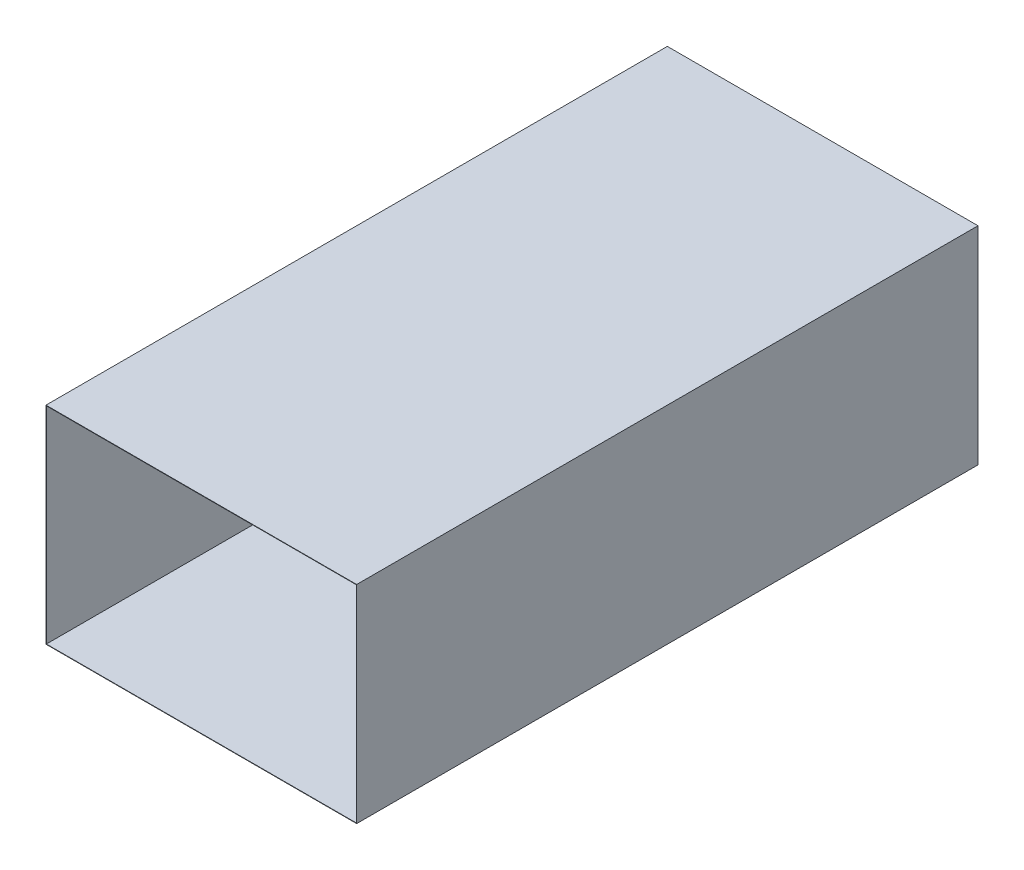
ISO-10303-21;
HEADER;
FILE_DESCRIPTION(('STEP AP214'),'2;1');
FILE_NAME('part.step','',(''),(''),'','','');
FILE_SCHEMA(('AUTOMOTIVE_DESIGN { 1 0 10303 214 1 1 1 1 }'));
ENDSEC;
DATA;
#1=APPLICATION_CONTEXT('core data for automotive mechanical design processes');
#2=APPLICATION_PROTOCOL_DEFINITION('international standard','automotive_design',2000,#1);
#3=PRODUCT_CONTEXT('',#1,'mechanical');
#4=PRODUCT('Part','Part','',(#3));
#5=PRODUCT_RELATED_PRODUCT_CATEGORY('part','',(#4));
#6=PRODUCT_DEFINITION_FORMATION('','',#4);
#7=PRODUCT_DEFINITION_CONTEXT('part definition',#1,'design');
#8=PRODUCT_DEFINITION('design','',#6,#7);
#9=PRODUCT_DEFINITION_SHAPE('','',#8);
#10=(LENGTH_UNIT() NAMED_UNIT(*) SI_UNIT(.MILLI.,.METRE.));
#11=(NAMED_UNIT(*) PLANE_ANGLE_UNIT() SI_UNIT($,.RADIAN.));
#12=(NAMED_UNIT(*) SI_UNIT($,.STERADIAN.) SOLID_ANGLE_UNIT());
#13=UNCERTAINTY_MEASURE_WITH_UNIT(LENGTH_MEASURE(1.E-05),#10,'distance_accuracy_value','');
#14=(GEOMETRIC_REPRESENTATION_CONTEXT(3) GLOBAL_UNCERTAINTY_ASSIGNED_CONTEXT((#13)) GLOBAL_UNIT_ASSIGNED_CONTEXT((#10,
#11,#12)) REPRESENTATION_CONTEXT('',''));
#15=CARTESIAN_POINT('',(0.,0.,0.));
#16=DIRECTION('',(0.,0.,1.));
#17=DIRECTION('',(1.,0.,0.));
#18=AXIS2_PLACEMENT_3D('',#15,#16,#17);
#19=CARTESIAN_POINT('',(0.,0.,3000.));
#20=DIRECTION('',(0.,0.,1.));
#21=DIRECTION('',(1.,0.,0.));
#22=AXIS2_PLACEMENT_3D('',#19,#20,#21);
#23=PLANE('',#22);
#24=DIRECTION('',(0.,1.,0.));
#25=VECTOR('',#24,1.);
#26=CARTESIAN_POINT('',(750.,500.,3000.));
#27=LINE('',#26,#25);
#28=CARTESIAN_POINT('',(750.,-500.,3000.));
#29=VERTEX_POINT('',#28);
#30=CARTESIAN_POINT('',(750.,500.,3000.));
#31=VERTEX_POINT('',#30);
#32=EDGE_CURVE('E158',#29,#31,#27,.T.);
#33=ORIENTED_EDGE('',*,*,#32,.T.);
#34=DIRECTION('',(-1.,0.,0.));
#35=VECTOR('',#34,1.);
#36=CARTESIAN_POINT('',(-750.,500.,3000.));
#37=LINE('',#36,#35);
#38=CARTESIAN_POINT('',(-750.,500.,3000.));
#39=VERTEX_POINT('',#38);
#40=EDGE_CURVE('E161',#31,#39,#37,.T.);
#41=ORIENTED_EDGE('',*,*,#40,.T.);
#42=DIRECTION('',(0.,-1.,0.));
#43=VECTOR('',#42,1.);
#44=CARTESIAN_POINT('',(-750.,500.,3000.));
#45=LINE('',#44,#43);
#46=CARTESIAN_POINT('',(-750.,-500.,3000.));
#47=VERTEX_POINT('',#46);
#48=EDGE_CURVE('E164',#39,#47,#45,.T.);
#49=ORIENTED_EDGE('',*,*,#48,.T.);
#50=DIRECTION('',(1.,0.,0.));
#51=VECTOR('',#50,1.);
#52=CARTESIAN_POINT('',(-750.,-500.,3000.));
#53=LINE('',#52,#51);
#54=EDGE_CURVE('E166',#47,#29,#53,.T.);
#55=ORIENTED_EDGE('',*,*,#54,.T.);
#56=EDGE_LOOP('',(#33,#41,#49,#55));
#57=FACE_BOUND('',#56,.T.);
#58=DIRECTION('',(-1.,0.,0.));
#59=VECTOR('',#58,1.);
#60=CARTESIAN_POINT('',(-750.,498.,3000.));
#61=LINE('',#60,#59);
#62=CARTESIAN_POINT('',(748.,498.,3000.));
#63=VERTEX_POINT('',#62);
#64=CARTESIAN_POINT('',(-748.,498.,3000.));
#65=VERTEX_POINT('',#64);
#66=EDGE_CURVE('E130',#63,#65,#61,.T.);
#67=ORIENTED_EDGE('',*,*,#66,.F.);
#68=DIRECTION('',(0.,1.,0.));
#69=VECTOR('',#68,1.);
#70=CARTESIAN_POINT('',(748.,500.,3000.));
#71=LINE('',#70,#69);
#72=CARTESIAN_POINT('',(748.,-498.,3000.));
#73=VERTEX_POINT('',#72);
#74=EDGE_CURVE('E122',#73,#63,#71,.T.);
#75=ORIENTED_EDGE('',*,*,#74,.F.);
#76=DIRECTION('',(1.,0.,0.));
#77=VECTOR('',#76,1.);
#78=CARTESIAN_POINT('',(-750.,-498.,3000.));
#79=LINE('',#78,#77);
#80=CARTESIAN_POINT('',(-748.,-498.,3000.));
#81=VERTEX_POINT('',#80);
#82=EDGE_CURVE('E144',#81,#73,#79,.T.);
#83=ORIENTED_EDGE('',*,*,#82,.F.);
#84=DIRECTION('',(0.,-1.,0.));
#85=VECTOR('',#84,1.);
#86=CARTESIAN_POINT('',(-748.,500.,3000.));
#87=LINE('',#86,#85);
#88=EDGE_CURVE('E142',#65,#81,#87,.T.);
#89=ORIENTED_EDGE('',*,*,#88,.F.);
#90=EDGE_LOOP('',(#67,#75,#83,#89));
#91=FACE_BOUND('',#90,.T.);
#92=ADVANCED_FACE('F57',(#57,#91),#23,.T.);
#93=CARTESIAN_POINT('',(0.,0.,0.));
#94=DIRECTION('',(0.,0.,1.));
#95=DIRECTION('',(1.,0.,0.));
#96=AXIS2_PLACEMENT_3D('',#93,#94,#95);
#97=PLANE('',#96);
#98=DIRECTION('',(0.,1.,0.));
#99=VECTOR('',#98,1.);
#100=CARTESIAN_POINT('',(750.,500.,0.));
#101=LINE('',#100,#99);
#102=CARTESIAN_POINT('',(750.,-500.,0.));
#103=VERTEX_POINT('',#102);
#104=CARTESIAN_POINT('',(750.,500.,0.));
#105=VERTEX_POINT('',#104);
#106=EDGE_CURVE('E138',#103,#105,#101,.T.);
#107=ORIENTED_EDGE('',*,*,#106,.F.);
#108=DIRECTION('',(1.,0.,0.));
#109=VECTOR('',#108,1.);
#110=CARTESIAN_POINT('',(-750.,-500.,0.));
#111=LINE('',#110,#109);
#112=CARTESIAN_POINT('',(-750.,-500.,0.));
#113=VERTEX_POINT('',#112);
#114=EDGE_CURVE('E162',#113,#103,#111,.T.);
#115=ORIENTED_EDGE('',*,*,#114,.F.);
#116=DIRECTION('',(0.,-1.,0.));
#117=VECTOR('',#116,1.);
#118=CARTESIAN_POINT('',(-750.,500.,0.));
#119=LINE('',#118,#117);
#120=CARTESIAN_POINT('',(-750.,500.,0.));
#121=VERTEX_POINT('',#120);
#122=EDGE_CURVE('E173',#121,#113,#119,.T.);
#123=ORIENTED_EDGE('',*,*,#122,.F.);
#124=DIRECTION('',(-1.,0.,0.));
#125=VECTOR('',#124,1.);
#126=CARTESIAN_POINT('',(-750.,500.,0.));
#127=LINE('',#126,#125);
#128=EDGE_CURVE('E171',#105,#121,#127,.T.);
#129=ORIENTED_EDGE('',*,*,#128,.F.);
#130=EDGE_LOOP('',(#107,#115,#123,#129));
#131=FACE_BOUND('',#130,.T.);
#132=DIRECTION('',(0.,1.,0.));
#133=VECTOR('',#132,1.);
#134=CARTESIAN_POINT('',(748.,500.,0.));
#135=LINE('',#134,#133);
#136=CARTESIAN_POINT('',(748.,-498.,0.));
#137=VERTEX_POINT('',#136);
#138=CARTESIAN_POINT('',(748.,498.,0.));
#139=VERTEX_POINT('',#138);
#140=EDGE_CURVE('E80',#137,#139,#135,.T.);
#141=ORIENTED_EDGE('',*,*,#140,.T.);
#142=DIRECTION('',(-1.,0.,0.));
#143=VECTOR('',#142,1.);
#144=CARTESIAN_POINT('',(-750.,498.,0.));
#145=LINE('',#144,#143);
#146=CARTESIAN_POINT('',(-748.,498.,0.));
#147=VERTEX_POINT('',#146);
#148=EDGE_CURVE('E137',#139,#147,#145,.T.);
#149=ORIENTED_EDGE('',*,*,#148,.T.);
#150=DIRECTION('',(0.,-1.,0.));
#151=VECTOR('',#150,1.);
#152=CARTESIAN_POINT('',(-748.,500.,0.));
#153=LINE('',#152,#151);
#154=CARTESIAN_POINT('',(-748.,-498.,0.));
#155=VERTEX_POINT('',#154);
#156=EDGE_CURVE('E150',#147,#155,#153,.T.);
#157=ORIENTED_EDGE('',*,*,#156,.T.);
#158=DIRECTION('',(1.,0.,0.));
#159=VECTOR('',#158,1.);
#160=CARTESIAN_POINT('',(-750.,-498.,0.));
#161=LINE('',#160,#159);
#162=EDGE_CURVE('E131',#155,#137,#161,.T.);
#163=ORIENTED_EDGE('',*,*,#162,.T.);
#164=EDGE_LOOP('',(#141,#149,#157,#163));
#165=FACE_BOUND('',#164,.T.);
#166=ADVANCED_FACE('F191',(#131,#165),#97,.F.);
#167=CARTESIAN_POINT('',(750.,500.,3000.));
#168=DIRECTION('',(-1.,0.,0.));
#169=DIRECTION('',(0.,-1.,0.));
#170=AXIS2_PLACEMENT_3D('',#167,#168,#169);
#171=PLANE('',#170);
#172=ORIENTED_EDGE('',*,*,#106,.T.);
#173=DIRECTION('',(0.,0.,-1.));
#174=VECTOR('',#173,1.);
#175=CARTESIAN_POINT('',(750.,500.,3000.));
#176=LINE('',#175,#174);
#177=EDGE_CURVE('E12',#31,#105,#176,.T.);
#178=ORIENTED_EDGE('',*,*,#177,.F.);
#179=ORIENTED_EDGE('',*,*,#32,.F.);
#180=DIRECTION('',(0.,0.,-1.));
#181=VECTOR('',#180,1.);
#182=CARTESIAN_POINT('',(750.,-500.,3000.));
#183=LINE('',#182,#181);
#184=EDGE_CURVE('E168',#29,#103,#183,.T.);
#185=ORIENTED_EDGE('',*,*,#184,.T.);
#186=EDGE_LOOP('',(#172,#178,#179,#185));
#187=FACE_BOUND('',#186,.T.);
#188=ADVANCED_FACE('F59',(#187),#171,.F.);
#189=CARTESIAN_POINT('',(-750.,500.,3000.));
#190=DIRECTION('',(0.,-1.,0.));
#191=DIRECTION('',(0.,0.,-1.));
#192=AXIS2_PLACEMENT_3D('',#189,#190,#191);
#193=PLANE('',#192);
#194=ORIENTED_EDGE('',*,*,#128,.T.);
#195=DIRECTION('',(0.,0.,-1.));
#196=VECTOR('',#195,1.);
#197=CARTESIAN_POINT('',(-750.,500.,3000.));
#198=LINE('',#197,#196);
#199=EDGE_CURVE('E65',#39,#121,#198,.T.);
#200=ORIENTED_EDGE('',*,*,#199,.F.);
#201=ORIENTED_EDGE('',*,*,#40,.F.);
#202=ORIENTED_EDGE('',*,*,#177,.T.);
#203=EDGE_LOOP('',(#194,#200,#201,#202));
#204=FACE_BOUND('',#203,.T.);
#205=ADVANCED_FACE('F201',(#204),#193,.F.);
#206=CARTESIAN_POINT('',(-750.,500.,3000.));
#207=DIRECTION('',(1.,0.,0.));
#208=DIRECTION('',(0.,1.,0.));
#209=AXIS2_PLACEMENT_3D('',#206,#207,#208);
#210=PLANE('',#209);
#211=ORIENTED_EDGE('',*,*,#122,.T.);
#212=DIRECTION('',(0.,0.,-1.));
#213=VECTOR('',#212,1.);
#214=CARTESIAN_POINT('',(-750.,-500.,3000.));
#215=LINE('',#214,#213);
#216=EDGE_CURVE('E178',#47,#113,#215,.T.);
#217=ORIENTED_EDGE('',*,*,#216,.F.);
#218=ORIENTED_EDGE('',*,*,#48,.F.);
#219=ORIENTED_EDGE('',*,*,#199,.T.);
#220=EDGE_LOOP('',(#211,#217,#218,#219));
#221=FACE_BOUND('',#220,.T.);
#222=ADVANCED_FACE('F185',(#221),#210,.F.);
#223=CARTESIAN_POINT('',(-750.,-500.,3000.));
#224=DIRECTION('',(0.,1.,0.));
#225=DIRECTION('',(0.,0.,1.));
#226=AXIS2_PLACEMENT_3D('',#223,#224,#225);
#227=PLANE('',#226);
#228=ORIENTED_EDGE('',*,*,#114,.T.);
#229=ORIENTED_EDGE('',*,*,#184,.F.);
#230=ORIENTED_EDGE('',*,*,#54,.F.);
#231=ORIENTED_EDGE('',*,*,#216,.T.);
#232=EDGE_LOOP('',(#228,#229,#230,#231));
#233=FACE_BOUND('',#232,.T.);
#234=ADVANCED_FACE('F195',(#233),#227,.F.);
#235=CARTESIAN_POINT('',(748.,500.,3000.));
#236=DIRECTION('',(-1.,0.,0.));
#237=DIRECTION('',(0.,-1.,0.));
#238=AXIS2_PLACEMENT_3D('',#235,#236,#237);
#239=PLANE('',#238);
#240=ORIENTED_EDGE('',*,*,#140,.F.);
#241=DIRECTION('',(0.,0.,-1.));
#242=VECTOR('',#241,1.);
#243=CARTESIAN_POINT('',(748.,-498.,3000.));
#244=LINE('',#243,#242);
#245=EDGE_CURVE('E126',#73,#137,#244,.T.);
#246=ORIENTED_EDGE('',*,*,#245,.F.);
#247=ORIENTED_EDGE('',*,*,#74,.T.);
#248=DIRECTION('',(0.,0.,-1.));
#249=VECTOR('',#248,1.);
#250=CARTESIAN_POINT('',(748.,498.,3000.));
#251=LINE('',#250,#249);
#252=EDGE_CURVE('E125',#63,#139,#251,.T.);
#253=ORIENTED_EDGE('',*,*,#252,.T.);
#254=EDGE_LOOP('',(#240,#246,#247,#253));
#255=FACE_BOUND('',#254,.T.);
#256=ADVANCED_FACE('F124',(#255),#239,.T.);
#257=CARTESIAN_POINT('',(-750.,498.,3000.));
#258=DIRECTION('',(0.,-1.,0.));
#259=DIRECTION('',(0.,0.,-1.));
#260=AXIS2_PLACEMENT_3D('',#257,#258,#259);
#261=PLANE('',#260);
#262=ORIENTED_EDGE('',*,*,#148,.F.);
#263=ORIENTED_EDGE('',*,*,#252,.F.);
#264=ORIENTED_EDGE('',*,*,#66,.T.);
#265=DIRECTION('',(0.,0.,-1.));
#266=VECTOR('',#265,1.);
#267=CARTESIAN_POINT('',(-748.,498.,3000.));
#268=LINE('',#267,#266);
#269=EDGE_CURVE('E139',#65,#147,#268,.T.);
#270=ORIENTED_EDGE('',*,*,#269,.T.);
#271=EDGE_LOOP('',(#262,#263,#264,#270));
#272=FACE_BOUND('',#271,.T.);
#273=ADVANCED_FACE('F134',(#272),#261,.T.);
#274=CARTESIAN_POINT('',(-748.,500.,3000.));
#275=DIRECTION('',(1.,0.,0.));
#276=DIRECTION('',(0.,1.,0.));
#277=AXIS2_PLACEMENT_3D('',#274,#275,#276);
#278=PLANE('',#277);
#279=ORIENTED_EDGE('',*,*,#156,.F.);
#280=ORIENTED_EDGE('',*,*,#269,.F.);
#281=ORIENTED_EDGE('',*,*,#88,.T.);
#282=DIRECTION('',(0.,0.,-1.));
#283=VECTOR('',#282,1.);
#284=CARTESIAN_POINT('',(-748.,-498.,3000.));
#285=LINE('',#284,#283);
#286=EDGE_CURVE('E72',#81,#155,#285,.T.);
#287=ORIENTED_EDGE('',*,*,#286,.T.);
#288=EDGE_LOOP('',(#279,#280,#281,#287));
#289=FACE_BOUND('',#288,.T.);
#290=ADVANCED_FACE('F224',(#289),#278,.T.);
#291=CARTESIAN_POINT('',(-750.,-498.,3000.));
#292=DIRECTION('',(0.,1.,0.));
#293=DIRECTION('',(0.,0.,1.));
#294=AXIS2_PLACEMENT_3D('',#291,#292,#293);
#295=PLANE('',#294);
#296=ORIENTED_EDGE('',*,*,#162,.F.);
#297=ORIENTED_EDGE('',*,*,#286,.F.);
#298=ORIENTED_EDGE('',*,*,#82,.T.);
#299=ORIENTED_EDGE('',*,*,#245,.T.);
#300=EDGE_LOOP('',(#296,#297,#298,#299));
#301=FACE_BOUND('',#300,.T.);
#302=ADVANCED_FACE('F228',(#301),#295,.T.);
#303=CLOSED_SHELL('',(#92,#166,#188,#205,#222,#234,#256,#273,#290,#302));
#304=MANIFOLD_SOLID_BREP('B2',#303);
#305=ADVANCED_BREP_SHAPE_REPRESENTATION('',(#18,#304),#14);
#306=SHAPE_DEFINITION_REPRESENTATION(#9,#305);
ENDSEC;
END-ISO-10303-21;
